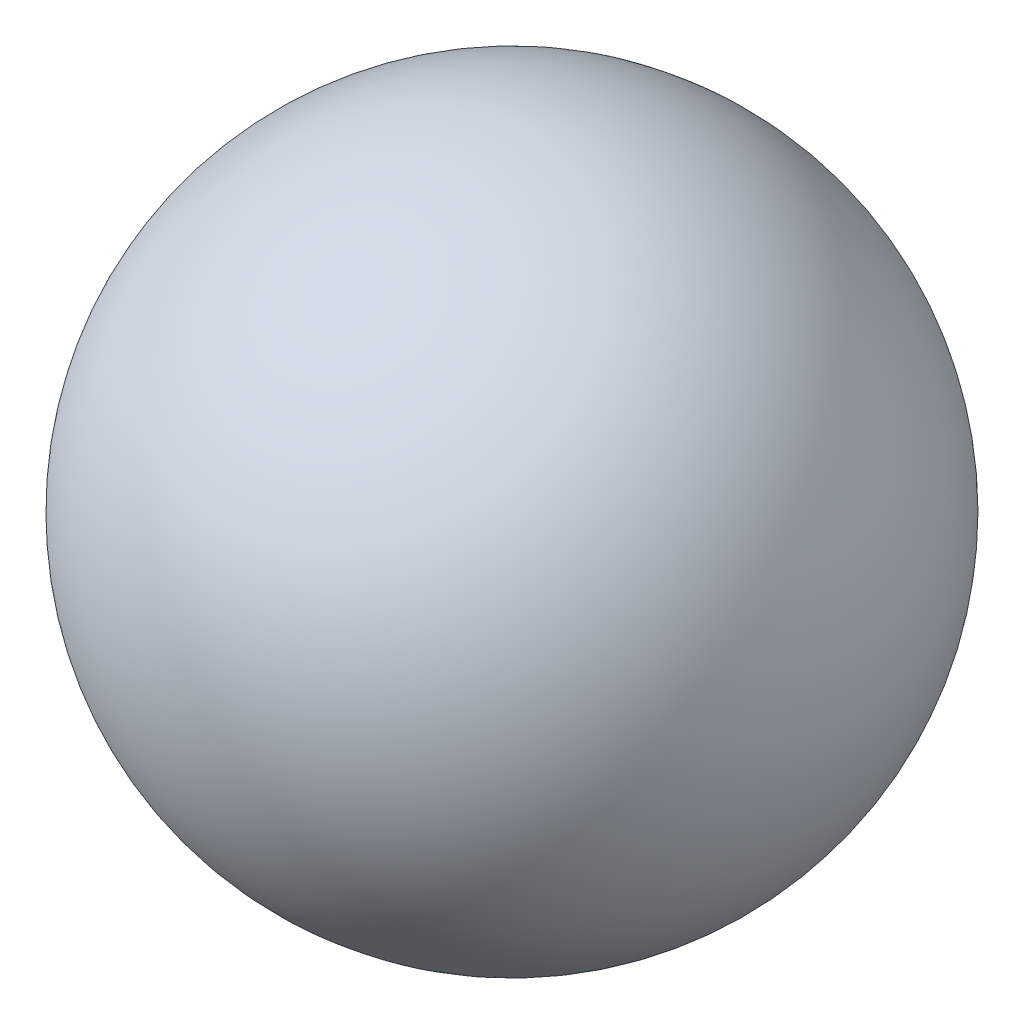
ISO-10303-21;
HEADER;
FILE_DESCRIPTION(('STEP AP214'),'2;1');
FILE_NAME('part.step','',(''),(''),'','','');
FILE_SCHEMA(('AUTOMOTIVE_DESIGN { 1 0 10303 214 1 1 1 1 }'));
ENDSEC;
DATA;
#1=APPLICATION_CONTEXT('core data for automotive mechanical design processes');
#2=APPLICATION_PROTOCOL_DEFINITION('international standard','automotive_design',2000,#1);
#3=PRODUCT_CONTEXT('',#1,'mechanical');
#4=PRODUCT('Part','Part','',(#3));
#5=PRODUCT_RELATED_PRODUCT_CATEGORY('part','',(#4));
#6=PRODUCT_DEFINITION_FORMATION('','',#4);
#7=PRODUCT_DEFINITION_CONTEXT('part definition',#1,'design');
#8=PRODUCT_DEFINITION('design','',#6,#7);
#9=PRODUCT_DEFINITION_SHAPE('','',#8);
#10=(LENGTH_UNIT() NAMED_UNIT(*) SI_UNIT(.MILLI.,.METRE.));
#11=(NAMED_UNIT(*) PLANE_ANGLE_UNIT() SI_UNIT($,.RADIAN.));
#12=(NAMED_UNIT(*) SI_UNIT($,.STERADIAN.) SOLID_ANGLE_UNIT());
#13=UNCERTAINTY_MEASURE_WITH_UNIT(LENGTH_MEASURE(1.E-05),#10,'distance_accuracy_value','');
#14=(GEOMETRIC_REPRESENTATION_CONTEXT(3) GLOBAL_UNCERTAINTY_ASSIGNED_CONTEXT((#13)) GLOBAL_UNIT_ASSIGNED_CONTEXT((#10,
#11,#12)) REPRESENTATION_CONTEXT('',''));
#15=CARTESIAN_POINT('',(0.,0.,0.));
#16=DIRECTION('',(0.,0.,1.));
#17=DIRECTION('',(1.,0.,0.));
#18=AXIS2_PLACEMENT_3D('',#15,#16,#17);
#19=CARTESIAN_POINT('',(67.76,61.8486902183248,-31.3658297280287));
#20=DIRECTION('',(0.,0.891866184337212,-0.452299357987365));
#21=DIRECTION('',(0.173648177666933,0.445427914428401,0.878316732984701));
#22=AXIS2_PLACEMENT_3D('',#19,#20,#21);
#23=SPHERICAL_SURFACE('',#22,7.15);
#24=CARTESIAN_POINT('',(67.76,68.2255334363359,-34.5997701376384));
#25=VERTEX_POINT('',#24);
#26=VERTEX_LOOP('',#25);
#27=FACE_BOUND('',#26,.T.);
#28=CARTESIAN_POINT('',(67.76,55.4718470003137,-28.131889318419));
#29=VERTEX_POINT('',#28);
#30=VERTEX_LOOP('',#29);
#31=FACE_BOUND('',#30,.T.);
#32=ADVANCED_FACE('F16',(#27,#31),#23,.T.);
#33=CLOSED_SHELL('',(#32));
#34=MANIFOLD_SOLID_BREP('B1',#33);
#35=ADVANCED_BREP_SHAPE_REPRESENTATION('',(#18,#34),#14);
#36=SHAPE_DEFINITION_REPRESENTATION(#9,#35);
ENDSEC;
END-ISO-10303-21;
